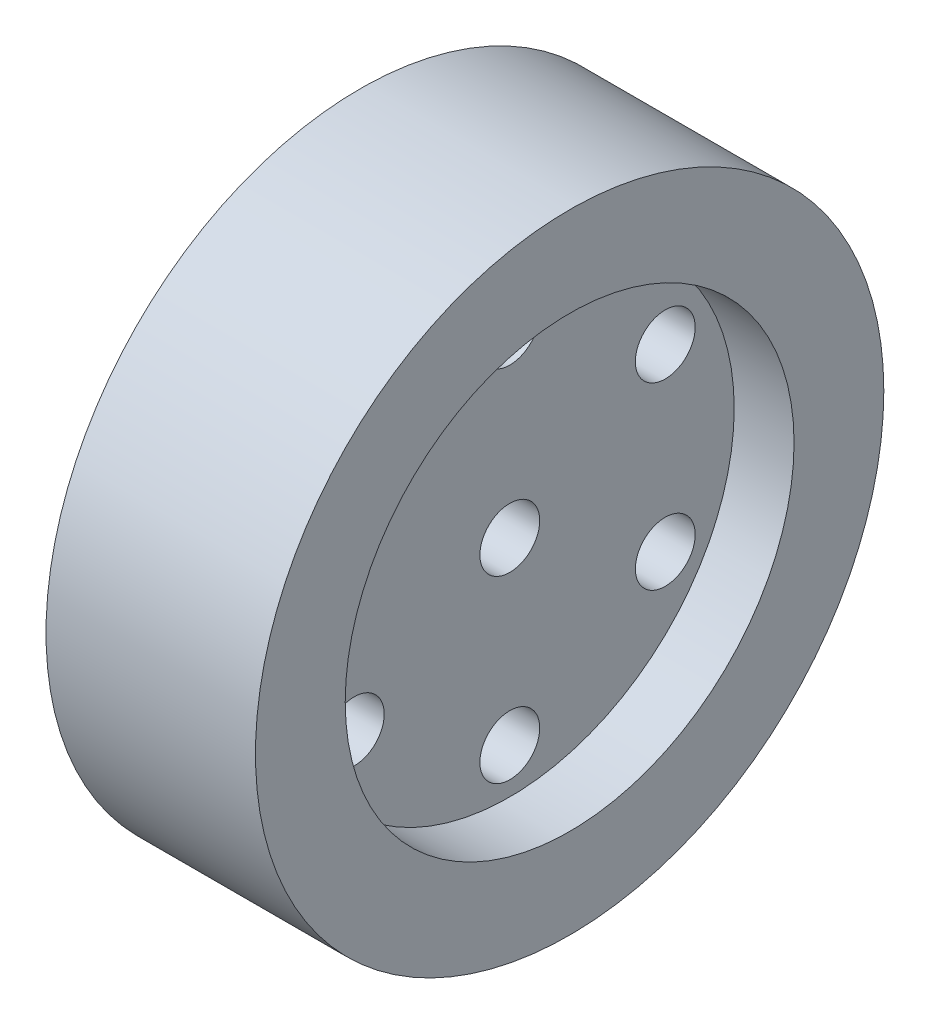
ISO-10303-21;
HEADER;
FILE_DESCRIPTION(('STEP AP214'),'2;1');
FILE_NAME('part.step','',(''),(''),'','','');
FILE_SCHEMA(('AUTOMOTIVE_DESIGN { 1 0 10303 214 1 1 1 1 }'));
ENDSEC;
DATA;
#1=APPLICATION_CONTEXT('core data for automotive mechanical design processes');
#2=APPLICATION_PROTOCOL_DEFINITION('international standard','automotive_design',2000,#1);
#3=PRODUCT_CONTEXT('',#1,'mechanical');
#4=PRODUCT('Part','Part','',(#3));
#5=PRODUCT_RELATED_PRODUCT_CATEGORY('part','',(#4));
#6=PRODUCT_DEFINITION_FORMATION('','',#4);
#7=PRODUCT_DEFINITION_CONTEXT('part definition',#1,'design');
#8=PRODUCT_DEFINITION('design','',#6,#7);
#9=PRODUCT_DEFINITION_SHAPE('','',#8);
#10=(LENGTH_UNIT() NAMED_UNIT(*) SI_UNIT(.MILLI.,.METRE.));
#11=(NAMED_UNIT(*) PLANE_ANGLE_UNIT() SI_UNIT($,.RADIAN.));
#12=(NAMED_UNIT(*) SI_UNIT($,.STERADIAN.) SOLID_ANGLE_UNIT());
#13=UNCERTAINTY_MEASURE_WITH_UNIT(LENGTH_MEASURE(1.E-05),#10,'distance_accuracy_value','');
#14=(GEOMETRIC_REPRESENTATION_CONTEXT(3) GLOBAL_UNCERTAINTY_ASSIGNED_CONTEXT((#13)) GLOBAL_UNIT_ASSIGNED_CONTEXT((#10,
#11,#12)) REPRESENTATION_CONTEXT('',''));
#15=CARTESIAN_POINT('',(0.,0.,0.));
#16=DIRECTION('',(0.,0.,1.));
#17=DIRECTION('',(1.,0.,0.));
#18=AXIS2_PLACEMENT_3D('',#15,#16,#17);
#19=CARTESIAN_POINT('',(0.,0.,0.));
#20=DIRECTION('',(1.,0.,0.));
#21=DIRECTION('',(0.,0.,-1.));
#22=AXIS2_PLACEMENT_3D('',#19,#20,#21);
#23=PLANE('',#22);
#24=CARTESIAN_POINT('',(0.,0.,0.));
#25=DIRECTION('',(1.,0.,0.));
#26=DIRECTION('',(0.,0.,-1.));
#27=AXIS2_PLACEMENT_3D('',#24,#25,#26);
#28=CIRCLE('',#27,1.);
#29=CARTESIAN_POINT('',(0.,0.,-1.));
#30=VERTEX_POINT('',#29);
#31=EDGE_CURVE('E78',#30,#30,#28,.T.);
#32=ORIENTED_EDGE('',*,*,#31,.T.);
#33=EDGE_LOOP('',(#32));
#34=FACE_BOUND('',#33,.T.);
#35=CARTESIAN_POINT('',(0.,0.,0.));
#36=DIRECTION('',(-1.,0.,0.));
#37=DIRECTION('',(0.,0.,1.));
#38=AXIS2_PLACEMENT_3D('',#35,#36,#37);
#39=CIRCLE('',#38,2.5);
#40=CARTESIAN_POINT('',(0.,0.,2.5));
#41=VERTEX_POINT('',#40);
#42=EDGE_CURVE('E104',#41,#41,#39,.T.);
#43=ORIENTED_EDGE('',*,*,#42,.T.);
#44=EDGE_LOOP('',(#43));
#45=FACE_BOUND('',#44,.T.);
#46=ADVANCED_FACE('F38',(#34,#45),#23,.F.);
#47=CARTESIAN_POINT('',(0.,2.99999999999985,5.19615242270655));
#48=DIRECTION('',(1.,0.,0.));
#49=DIRECTION('',(0.,0.,-1.));
#50=AXIS2_PLACEMENT_3D('',#47,#48,#49);
#51=CYLINDRICAL_SURFACE('',#50,1.0000000000002);
#52=CARTESIAN_POINT('',(5.,2.99999999999985,5.19615242270655));
#53=DIRECTION('',(1.,0.,0.));
#54=DIRECTION('',(0.,0.,-1.));
#55=AXIS2_PLACEMENT_3D('',#52,#53,#54);
#56=CIRCLE('',#55,1.0000000000002);
#57=CARTESIAN_POINT('',(5.,2.99999999999985,4.19615242270635));
#58=VERTEX_POINT('',#57);
#59=EDGE_CURVE('E59',#58,#58,#56,.T.);
#60=ORIENTED_EDGE('',*,*,#59,.T.);
#61=EDGE_LOOP('',(#60));
#62=FACE_BOUND('',#61,.T.);
#63=CARTESIAN_POINT('',(2.,2.99999999999985,5.19615242270655));
#64=DIRECTION('',(-1.,0.,0.));
#65=DIRECTION('',(0.,0.,1.));
#66=AXIS2_PLACEMENT_3D('',#63,#64,#65);
#67=CIRCLE('',#66,1.0000000000002);
#68=CARTESIAN_POINT('',(2.,2.99999999999985,6.19615242270675));
#69=VERTEX_POINT('',#68);
#70=EDGE_CURVE('E63',#69,#69,#67,.F.);
#71=ORIENTED_EDGE('',*,*,#70,.F.);
#72=EDGE_LOOP('',(#71));
#73=FACE_BOUND('',#72,.T.);
#74=ADVANCED_FACE('F134',(#62,#73),#51,.F.);
#75=CARTESIAN_POINT('',(0.,-3.00000000000015,5.19615242270638));
#76=DIRECTION('',(1.,0.,0.));
#77=DIRECTION('',(0.,0.,-1.));
#78=AXIS2_PLACEMENT_3D('',#75,#76,#77);
#79=CYLINDRICAL_SURFACE('',#78,1.00000000000034);
#80=CARTESIAN_POINT('',(5.,-3.00000000000015,5.19615242270638));
#81=DIRECTION('',(1.,0.,0.));
#82=DIRECTION('',(0.,0.,-1.));
#83=AXIS2_PLACEMENT_3D('',#80,#81,#82);
#84=CIRCLE('',#83,1.00000000000034);
#85=CARTESIAN_POINT('',(5.,-3.00000000000015,4.19615242270604));
#86=VERTEX_POINT('',#85);
#87=EDGE_CURVE('E62',#86,#86,#84,.T.);
#88=ORIENTED_EDGE('',*,*,#87,.T.);
#89=EDGE_LOOP('',(#88));
#90=FACE_BOUND('',#89,.T.);
#91=CARTESIAN_POINT('',(2.,-3.00000000000015,5.19615242270638));
#92=DIRECTION('',(-1.,0.,0.));
#93=DIRECTION('',(0.,0.,1.));
#94=AXIS2_PLACEMENT_3D('',#91,#92,#93);
#95=CIRCLE('',#94,1.00000000000034);
#96=CARTESIAN_POINT('',(2.,-3.00000000000015,6.19615242270672));
#97=VERTEX_POINT('',#96);
#98=EDGE_CURVE('E85',#97,#97,#95,.F.);
#99=ORIENTED_EDGE('',*,*,#98,.F.);
#100=EDGE_LOOP('',(#99));
#101=FACE_BOUND('',#100,.T.);
#102=ADVANCED_FACE('F136',(#90,#101),#79,.F.);
#103=CARTESIAN_POINT('',(0.,-6.,-3.38856148926383E-13));
#104=DIRECTION('',(1.,0.,0.));
#105=DIRECTION('',(0.,0.,-1.));
#106=AXIS2_PLACEMENT_3D('',#103,#104,#105);
#107=CYLINDRICAL_SURFACE('',#106,1.00000000000036);
#108=CARTESIAN_POINT('',(5.,-6.,-3.38856148926383E-13));
#109=DIRECTION('',(1.,0.,0.));
#110=DIRECTION('',(0.,0.,-1.));
#111=AXIS2_PLACEMENT_3D('',#108,#109,#110);
#112=CIRCLE('',#111,1.00000000000036);
#113=CARTESIAN_POINT('',(5.,-6.,-1.0000000000007));
#114=VERTEX_POINT('',#113);
#115=EDGE_CURVE('E66',#114,#114,#112,.T.);
#116=ORIENTED_EDGE('',*,*,#115,.T.);
#117=EDGE_LOOP('',(#116));
#118=FACE_BOUND('',#117,.T.);
#119=CARTESIAN_POINT('',(2.,-6.,-3.38856148926383E-13));
#120=DIRECTION('',(-1.,0.,0.));
#121=DIRECTION('',(0.,0.,1.));
#122=AXIS2_PLACEMENT_3D('',#119,#120,#121);
#123=CIRCLE('',#122,1.00000000000036);
#124=CARTESIAN_POINT('',(2.,-6.,1.00000000000003));
#125=VERTEX_POINT('',#124);
#126=EDGE_CURVE('E88',#125,#125,#123,.F.);
#127=ORIENTED_EDGE('',*,*,#126,.F.);
#128=EDGE_LOOP('',(#127));
#129=FACE_BOUND('',#128,.T.);
#130=ADVANCED_FACE('F143',(#118,#129),#107,.F.);
#131=CARTESIAN_POINT('',(0.,-2.99999999999985,-5.19615242270689));
#132=DIRECTION('',(1.,0.,0.));
#133=DIRECTION('',(0.,0.,-1.));
#134=AXIS2_PLACEMENT_3D('',#131,#132,#133);
#135=CYLINDRICAL_SURFACE('',#134,1.00000000000023);
#136=CARTESIAN_POINT('',(5.,-2.99999999999985,-5.19615242270689));
#137=DIRECTION('',(1.,0.,0.));
#138=DIRECTION('',(0.,0.,-1.));
#139=AXIS2_PLACEMENT_3D('',#136,#137,#138);
#140=CIRCLE('',#139,1.00000000000023);
#141=CARTESIAN_POINT('',(5.,-2.99999999999985,-6.19615242270712));
#142=VERTEX_POINT('',#141);
#143=EDGE_CURVE('E69',#142,#142,#140,.T.);
#144=ORIENTED_EDGE('',*,*,#143,.T.);
#145=EDGE_LOOP('',(#144));
#146=FACE_BOUND('',#145,.T.);
#147=CARTESIAN_POINT('',(2.,-2.99999999999985,-5.19615242270689));
#148=DIRECTION('',(-1.,0.,0.));
#149=DIRECTION('',(0.,0.,1.));
#150=AXIS2_PLACEMENT_3D('',#147,#148,#149);
#151=CIRCLE('',#150,1.00000000000023);
#152=CARTESIAN_POINT('',(2.,-2.99999999999985,-4.19615242270666));
#153=VERTEX_POINT('',#152);
#154=EDGE_CURVE('E91',#153,#153,#151,.F.);
#155=ORIENTED_EDGE('',*,*,#154,.F.);
#156=EDGE_LOOP('',(#155));
#157=FACE_BOUND('',#156,.T.);
#158=ADVANCED_FACE('F181',(#146,#157),#135,.F.);
#159=CARTESIAN_POINT('',(0.,3.00000000000015,-5.19615242270672));
#160=DIRECTION('',(1.,0.,0.));
#161=DIRECTION('',(0.,0.,-1.));
#162=AXIS2_PLACEMENT_3D('',#159,#160,#161);
#163=CYLINDRICAL_SURFACE('',#162,1.00000000000005);
#164=CARTESIAN_POINT('',(5.,3.00000000000015,-5.19615242270672));
#165=DIRECTION('',(1.,0.,0.));
#166=DIRECTION('',(0.,0.,-1.));
#167=AXIS2_PLACEMENT_3D('',#164,#165,#166);
#168=CIRCLE('',#167,1.00000000000005);
#169=CARTESIAN_POINT('',(5.,3.00000000000015,-6.19615242270677));
#170=VERTEX_POINT('',#169);
#171=EDGE_CURVE('E72',#170,#170,#168,.T.);
#172=ORIENTED_EDGE('',*,*,#171,.T.);
#173=EDGE_LOOP('',(#172));
#174=FACE_BOUND('',#173,.T.);
#175=CARTESIAN_POINT('',(2.,3.00000000000015,-5.19615242270672));
#176=DIRECTION('',(-1.,0.,0.));
#177=DIRECTION('',(0.,0.,1.));
#178=AXIS2_PLACEMENT_3D('',#175,#176,#177);
#179=CIRCLE('',#178,1.00000000000005);
#180=CARTESIAN_POINT('',(2.,3.00000000000015,-4.19615242270666));
#181=VERTEX_POINT('',#180);
#182=EDGE_CURVE('E94',#181,#181,#179,.F.);
#183=ORIENTED_EDGE('',*,*,#182,.F.);
#184=EDGE_LOOP('',(#183));
#185=FACE_BOUND('',#184,.T.);
#186=ADVANCED_FACE('F175',(#174,#185),#163,.F.);
#187=CARTESIAN_POINT('',(0.,6.,0.));
#188=DIRECTION('',(1.,0.,0.));
#189=DIRECTION('',(0.,0.,-1.));
#190=AXIS2_PLACEMENT_3D('',#187,#188,#189);
#191=CYLINDRICAL_SURFACE('',#190,1.);
#192=CARTESIAN_POINT('',(5.,6.,0.));
#193=DIRECTION('',(1.,0.,0.));
#194=DIRECTION('',(0.,0.,-1.));
#195=AXIS2_PLACEMENT_3D('',#192,#193,#194);
#196=CIRCLE('',#195,1.);
#197=CARTESIAN_POINT('',(5.,6.,-1.));
#198=VERTEX_POINT('',#197);
#199=EDGE_CURVE('E56',#198,#198,#196,.T.);
#200=ORIENTED_EDGE('',*,*,#199,.T.);
#201=EDGE_LOOP('',(#200));
#202=FACE_BOUND('',#201,.T.);
#203=CARTESIAN_POINT('',(2.,6.,0.));
#204=DIRECTION('',(-1.,0.,0.));
#205=DIRECTION('',(0.,0.,1.));
#206=AXIS2_PLACEMENT_3D('',#203,#204,#205);
#207=CIRCLE('',#206,1.);
#208=CARTESIAN_POINT('',(2.,6.,1.));
#209=VERTEX_POINT('',#208);
#210=EDGE_CURVE('E42',#209,#209,#207,.F.);
#211=ORIENTED_EDGE('',*,*,#210,.F.);
#212=EDGE_LOOP('',(#211));
#213=FACE_BOUND('',#212,.T.);
#214=ADVANCED_FACE('F170',(#202,#213),#191,.F.);
#215=CARTESIAN_POINT('',(7.,0.,0.));
#216=DIRECTION('',(-1.,0.,0.));
#217=DIRECTION('',(0.,0.,1.));
#218=AXIS2_PLACEMENT_3D('',#215,#216,#217);
#219=CYLINDRICAL_SURFACE('',#218,10.5);
#220=CARTESIAN_POINT('',(7.,0.,0.));
#221=DIRECTION('',(1.,0.,0.));
#222=DIRECTION('',(0.,0.,-1.));
#223=AXIS2_PLACEMENT_3D('',#220,#221,#222);
#224=CIRCLE('',#223,10.5);
#225=CARTESIAN_POINT('',(7.,0.,-10.5));
#226=VERTEX_POINT('',#225);
#227=EDGE_CURVE('E10',#226,#226,#224,.T.);
#228=ORIENTED_EDGE('',*,*,#227,.F.);
#229=EDGE_LOOP('',(#228));
#230=FACE_BOUND('',#229,.T.);
#231=CARTESIAN_POINT('',(0.,0.,0.));
#232=DIRECTION('',(1.,0.,0.));
#233=DIRECTION('',(0.,0.,-1.));
#234=AXIS2_PLACEMENT_3D('',#231,#232,#233);
#235=CIRCLE('',#234,10.5);
#236=CARTESIAN_POINT('',(0.,0.,-10.5));
#237=VERTEX_POINT('',#236);
#238=EDGE_CURVE('E46',#237,#237,#235,.T.);
#239=ORIENTED_EDGE('',*,*,#238,.T.);
#240=EDGE_LOOP('',(#239));
#241=FACE_BOUND('',#240,.T.);
#242=ADVANCED_FACE('F40',(#230,#241),#219,.T.);
#243=CARTESIAN_POINT('',(7.,0.,0.));
#244=DIRECTION('',(1.,0.,0.));
#245=DIRECTION('',(0.,0.,-1.));
#246=AXIS2_PLACEMENT_3D('',#243,#244,#245);
#247=PLANE('',#246);
#248=CARTESIAN_POINT('',(7.,0.,0.));
#249=DIRECTION('',(1.,0.,0.));
#250=DIRECTION('',(0.,0.,-1.));
#251=AXIS2_PLACEMENT_3D('',#248,#249,#250);
#252=CIRCLE('',#251,7.5);
#253=CARTESIAN_POINT('',(7.,0.,-7.5));
#254=VERTEX_POINT('',#253);
#255=EDGE_CURVE('E53',#254,#254,#252,.T.);
#256=ORIENTED_EDGE('',*,*,#255,.F.);
#257=EDGE_LOOP('',(#256));
#258=FACE_BOUND('',#257,.T.);
#259=ORIENTED_EDGE('',*,*,#227,.T.);
#260=EDGE_LOOP('',(#259));
#261=FACE_BOUND('',#260,.T.);
#262=ADVANCED_FACE('F158',(#258,#261),#247,.T.);
#263=CARTESIAN_POINT('',(0.,0.,0.));
#264=DIRECTION('',(-1.,0.,0.));
#265=DIRECTION('',(0.,0.,1.));
#266=AXIS2_PLACEMENT_3D('',#263,#264,#265);
#267=CIRCLE('',#266,9.5);
#268=CARTESIAN_POINT('',(0.,0.,9.5));
#269=VERTEX_POINT('',#268);
#270=EDGE_CURVE('E97',#269,#269,#267,.T.);
#271=ORIENTED_EDGE('',*,*,#270,.F.);
#272=EDGE_LOOP('',(#271));
#273=FACE_BOUND('',#272,.T.);
#274=ORIENTED_EDGE('',*,*,#238,.F.);
#275=EDGE_LOOP('',(#274));
#276=FACE_BOUND('',#275,.T.);
#277=ADVANCED_FACE('F147',(#273,#276),#23,.F.);
#278=CARTESIAN_POINT('',(5.,0.,0.));
#279=DIRECTION('',(1.,0.,0.));
#280=DIRECTION('',(0.,0.,-1.));
#281=AXIS2_PLACEMENT_3D('',#278,#279,#280);
#282=CYLINDRICAL_SURFACE('',#281,7.5);
#283=CARTESIAN_POINT('',(5.,0.,0.));
#284=DIRECTION('',(1.,0.,0.));
#285=DIRECTION('',(0.,0.,-1.));
#286=AXIS2_PLACEMENT_3D('',#283,#284,#285);
#287=CIRCLE('',#286,7.5);
#288=CARTESIAN_POINT('',(5.,0.,-7.5));
#289=VERTEX_POINT('',#288);
#290=EDGE_CURVE('E51',#289,#289,#287,.T.);
#291=ORIENTED_EDGE('',*,*,#290,.F.);
#292=EDGE_LOOP('',(#291));
#293=FACE_BOUND('',#292,.T.);
#294=ORIENTED_EDGE('',*,*,#255,.T.);
#295=EDGE_LOOP('',(#294));
#296=FACE_BOUND('',#295,.T.);
#297=ADVANCED_FACE('F153',(#293,#296),#282,.F.);
#298=CARTESIAN_POINT('',(5.,0.,0.));
#299=DIRECTION('',(1.,0.,0.));
#300=DIRECTION('',(0.,0.,-1.));
#301=AXIS2_PLACEMENT_3D('',#298,#299,#300);
#302=PLANE('',#301);
#303=ORIENTED_EDGE('',*,*,#199,.F.);
#304=EDGE_LOOP('',(#303));
#305=FACE_BOUND('',#304,.T.);
#306=CARTESIAN_POINT('',(5.,0.,0.));
#307=DIRECTION('',(1.,0.,0.));
#308=DIRECTION('',(0.,0.,-1.));
#309=AXIS2_PLACEMENT_3D('',#306,#307,#308);
#310=CIRCLE('',#309,1.);
#311=CARTESIAN_POINT('',(5.,0.,-1.));
#312=VERTEX_POINT('',#311);
#313=EDGE_CURVE('E75',#312,#312,#310,.T.);
#314=ORIENTED_EDGE('',*,*,#313,.F.);
#315=EDGE_LOOP('',(#314));
#316=FACE_BOUND('',#315,.T.);
#317=ORIENTED_EDGE('',*,*,#171,.F.);
#318=EDGE_LOOP('',(#317));
#319=FACE_BOUND('',#318,.T.);
#320=ORIENTED_EDGE('',*,*,#143,.F.);
#321=EDGE_LOOP('',(#320));
#322=FACE_BOUND('',#321,.T.);
#323=ORIENTED_EDGE('',*,*,#115,.F.);
#324=EDGE_LOOP('',(#323));
#325=FACE_BOUND('',#324,.T.);
#326=ORIENTED_EDGE('',*,*,#87,.F.);
#327=EDGE_LOOP('',(#326));
#328=FACE_BOUND('',#327,.T.);
#329=ORIENTED_EDGE('',*,*,#59,.F.);
#330=EDGE_LOOP('',(#329));
#331=FACE_BOUND('',#330,.T.);
#332=ORIENTED_EDGE('',*,*,#290,.T.);
#333=EDGE_LOOP('',(#332));
#334=FACE_BOUND('',#333,.T.);
#335=ADVANCED_FACE('F150',(#305,#316,#319,#322,#325,#328,#331,#334),#302,.T.);
#336=CARTESIAN_POINT('',(0.,0.,0.));
#337=DIRECTION('',(1.,0.,0.));
#338=DIRECTION('',(0.,0.,-1.));
#339=AXIS2_PLACEMENT_3D('',#336,#337,#338);
#340=CYLINDRICAL_SURFACE('',#339,1.);
#341=ORIENTED_EDGE('',*,*,#31,.F.);
#342=EDGE_LOOP('',(#341));
#343=FACE_BOUND('',#342,.T.);
#344=ORIENTED_EDGE('',*,*,#313,.T.);
#345=EDGE_LOOP('',(#344));
#346=FACE_BOUND('',#345,.T.);
#347=ADVANCED_FACE('F117',(#343,#346),#340,.F.);
#348=CARTESIAN_POINT('',(2.,0.,0.));
#349=DIRECTION('',(-1.,0.,0.));
#350=DIRECTION('',(0.,0.,1.));
#351=AXIS2_PLACEMENT_3D('',#348,#349,#350);
#352=PLANE('',#351);
#353=CARTESIAN_POINT('',(2.,0.,0.));
#354=DIRECTION('',(-1.,0.,0.));
#355=DIRECTION('',(0.,0.,1.));
#356=AXIS2_PLACEMENT_3D('',#353,#354,#355);
#357=CIRCLE('',#356,2.5);
#358=CARTESIAN_POINT('',(2.,0.,2.5));
#359=VERTEX_POINT('',#358);
#360=EDGE_CURVE('E101',#359,#359,#357,.T.);
#361=ORIENTED_EDGE('',*,*,#360,.F.);
#362=EDGE_LOOP('',(#361));
#363=FACE_BOUND('',#362,.T.);
#364=CARTESIAN_POINT('',(2.,0.,0.));
#365=DIRECTION('',(-1.,0.,0.));
#366=DIRECTION('',(0.,0.,1.));
#367=AXIS2_PLACEMENT_3D('',#364,#365,#366);
#368=CIRCLE('',#367,9.5);
#369=CARTESIAN_POINT('',(2.,0.,9.5));
#370=VERTEX_POINT('',#369);
#371=EDGE_CURVE('E100',#370,#370,#368,.T.);
#372=ORIENTED_EDGE('',*,*,#371,.T.);
#373=EDGE_LOOP('',(#372));
#374=FACE_BOUND('',#373,.T.);
#375=ORIENTED_EDGE('',*,*,#210,.T.);
#376=EDGE_LOOP('',(#375));
#377=FACE_BOUND('',#376,.T.);
#378=ORIENTED_EDGE('',*,*,#182,.T.);
#379=EDGE_LOOP('',(#378));
#380=FACE_BOUND('',#379,.T.);
#381=ORIENTED_EDGE('',*,*,#154,.T.);
#382=EDGE_LOOP('',(#381));
#383=FACE_BOUND('',#382,.T.);
#384=ORIENTED_EDGE('',*,*,#126,.T.);
#385=EDGE_LOOP('',(#384));
#386=FACE_BOUND('',#385,.T.);
#387=ORIENTED_EDGE('',*,*,#98,.T.);
#388=EDGE_LOOP('',(#387));
#389=FACE_BOUND('',#388,.T.);
#390=ORIENTED_EDGE('',*,*,#70,.T.);
#391=EDGE_LOOP('',(#390));
#392=FACE_BOUND('',#391,.T.);
#393=ADVANCED_FACE('F113',(#363,#374,#377,#380,#383,#386,#389,#392),#352,.T.);
#394=CARTESIAN_POINT('',(2.,0.,0.));
#395=DIRECTION('',(-1.,0.,0.));
#396=DIRECTION('',(0.,0.,1.));
#397=AXIS2_PLACEMENT_3D('',#394,#395,#396);
#398=CYLINDRICAL_SURFACE('',#397,9.5);
#399=ORIENTED_EDGE('',*,*,#371,.F.);
#400=EDGE_LOOP('',(#399));
#401=FACE_BOUND('',#400,.T.);
#402=ORIENTED_EDGE('',*,*,#270,.T.);
#403=EDGE_LOOP('',(#402));
#404=FACE_BOUND('',#403,.T.);
#405=ADVANCED_FACE('F116',(#401,#404),#398,.F.);
#406=CARTESIAN_POINT('',(2.,0.,0.));
#407=DIRECTION('',(-1.,0.,0.));
#408=DIRECTION('',(0.,0.,1.));
#409=AXIS2_PLACEMENT_3D('',#406,#407,#408);
#410=CYLINDRICAL_SURFACE('',#409,2.5);
#411=ORIENTED_EDGE('',*,*,#360,.T.);
#412=EDGE_LOOP('',(#411));
#413=FACE_BOUND('',#412,.T.);
#414=ORIENTED_EDGE('',*,*,#42,.F.);
#415=EDGE_LOOP('',(#414));
#416=FACE_BOUND('',#415,.T.);
#417=ADVANCED_FACE('F110',(#413,#416),#410,.T.);
#418=CLOSED_SHELL('',(#46,#74,#102,#130,#158,#186,#214,#242,#262,#277,#297,#335,#347,#393,#405,#417));
#419=MANIFOLD_SOLID_BREP('B2',#418);
#420=ADVANCED_BREP_SHAPE_REPRESENTATION('',(#18,#419),#14);
#421=SHAPE_DEFINITION_REPRESENTATION(#9,#420);
ENDSEC;
END-ISO-10303-21;
